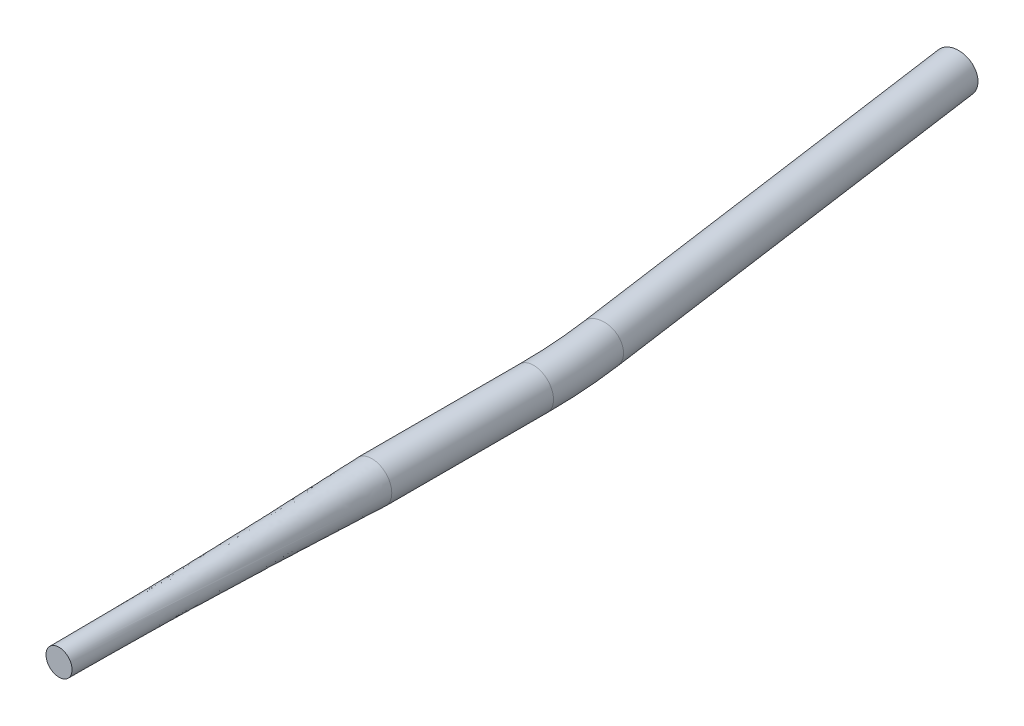
ISO-10303-21;
HEADER;
FILE_DESCRIPTION(('STEP AP214'),'2;1');
FILE_NAME('part.step','',(''),(''),'','','');
FILE_SCHEMA(('AUTOMOTIVE_DESIGN { 1 0 10303 214 1 1 1 1 }'));
ENDSEC;
DATA;
#1=APPLICATION_CONTEXT('core data for automotive mechanical design processes');
#2=APPLICATION_PROTOCOL_DEFINITION('international standard','automotive_design',2000,#1);
#3=PRODUCT_CONTEXT('',#1,'mechanical');
#4=PRODUCT('Part','Part','',(#3));
#5=PRODUCT_RELATED_PRODUCT_CATEGORY('part','',(#4));
#6=PRODUCT_DEFINITION_FORMATION('','',#4);
#7=PRODUCT_DEFINITION_CONTEXT('part definition',#1,'design');
#8=PRODUCT_DEFINITION('design','',#6,#7);
#9=PRODUCT_DEFINITION_SHAPE('','',#8);
#10=(LENGTH_UNIT() NAMED_UNIT(*) SI_UNIT(.MILLI.,.METRE.));
#11=(NAMED_UNIT(*) PLANE_ANGLE_UNIT() SI_UNIT($,.RADIAN.));
#12=(NAMED_UNIT(*) SI_UNIT($,.STERADIAN.) SOLID_ANGLE_UNIT());
#13=UNCERTAINTY_MEASURE_WITH_UNIT(LENGTH_MEASURE(1.E-05),#10,'distance_accuracy_value','');
#14=(GEOMETRIC_REPRESENTATION_CONTEXT(3) GLOBAL_UNCERTAINTY_ASSIGNED_CONTEXT((#13)) GLOBAL_UNIT_ASSIGNED_CONTEXT((#10,
#11,#12)) REPRESENTATION_CONTEXT('',''));
#15=CARTESIAN_POINT('',(0.,0.,0.));
#16=DIRECTION('',(0.,0.,1.));
#17=DIRECTION('',(1.,0.,0.));
#18=AXIS2_PLACEMENT_3D('',#15,#16,#17);
#19=CARTESIAN_POINT('',(0.,0.,0.));
#20=DIRECTION('',(0.,0.,-1.));
#21=DIRECTION('',(-1.,0.,0.));
#22=AXIS2_PLACEMENT_3D('',#19,#20,#21);
#23=CYLINDRICAL_SURFACE('',#22,9.5);
#24=CARTESIAN_POINT('',(0.,0.,-77.5182970141215));
#25=DIRECTION('',(0.,0.,1.));
#26=DIRECTION('',(1.,0.,0.));
#27=AXIS2_PLACEMENT_3D('',#24,#25,#26);
#28=CIRCLE('',#27,9.5);
#29=CARTESIAN_POINT('',(9.50000000000001,0.,-77.5182970141215));
#30=VERTEX_POINT('',#29);
#31=EDGE_CURVE('E64',#30,#30,#28,.T.);
#32=ORIENTED_EDGE('',*,*,#31,.T.);
#33=EDGE_LOOP('',(#32));
#34=FACE_BOUND('',#33,.T.);
#35=CARTESIAN_POINT('',(0.,0.,0.));
#36=DIRECTION('',(0.,0.,1.));
#37=DIRECTION('',(1.,0.,0.));
#38=AXIS2_PLACEMENT_3D('',#35,#36,#37);
#39=CIRCLE('',#38,9.5);
#40=CARTESIAN_POINT('',(9.5,0.,0.));
#41=VERTEX_POINT('',#40);
#42=EDGE_CURVE('E62',#41,#41,#39,.T.);
#43=ORIENTED_EDGE('',*,*,#42,.F.);
#44=EDGE_LOOP('',(#43));
#45=FACE_BOUND('',#44,.T.);
#46=ADVANCED_FACE('F41',(#34,#45),#23,.T.);
#47=CARTESIAN_POINT('',(-250.,0.,-77.5182970141223));
#48=DIRECTION('',(0.,1.,0.));
#49=DIRECTION('',(0.,0.,1.));
#50=AXIS2_PLACEMENT_3D('',#47,#48,#49);
#51=TOROIDAL_SURFACE('',#50,250.,9.5);
#52=CARTESIAN_POINT('',(-2.43298281460755,0.,-112.31157225414));
#53=DIRECTION('',(0.139173100960069,0.,0.99026806874157));
#54=DIRECTION('',(0.99026806874157,0.,-0.139173100960069));
#55=AXIS2_PLACEMENT_3D('',#52,#53,#54);
#56=CIRCLE('',#55,9.5);
#57=CARTESIAN_POINT('',(6.97456383843736,0.,-113.63371671326));
#58=VERTEX_POINT('',#57);
#59=EDGE_CURVE('E45',#58,#58,#56,.T.);
#60=CARTESIAN_POINT('',(-250.,0.,-77.5182970141223));
#61=DIRECTION('',(0.,1.,0.));
#62=DIRECTION('',(0.,0.,1.));
#63=AXIS2_PLACEMENT_3D('',#60,#61,#62);
#64=CIRCLE('',#63,259.5);
#65=EDGE_CURVE('',#30,#58,#64,.T.);
#66=ORIENTED_EDGE('',*,*,#31,.F.);
#67=ORIENTED_EDGE('',*,*,#59,.T.);
#68=ORIENTED_EDGE('',*,*,#65,.T.);
#69=ORIENTED_EDGE('',*,*,#65,.F.);
#70=EDGE_LOOP('',(#66,#68,#67,#69));
#71=FACE_BOUND('',#70,.T.);
#72=ADVANCED_FACE('F101',(#71),#51,.T.);
#73=CARTESIAN_POINT('',(-2.43298281460755,0.,-112.31157225414));
#74=DIRECTION('',(-0.139173100960066,0.,-0.99026806874157));
#75=DIRECTION('',(-0.99026806874157,0.,0.139173100960066));
#76=AXIS2_PLACEMENT_3D('',#73,#74,#75);
#77=CYLINDRICAL_SURFACE('',#76,9.5);
#78=CARTESIAN_POINT('',(-30.2162794610143,0.,-310.));
#79=DIRECTION('',(0.139173100960066,0.,0.99026806874157));
#80=DIRECTION('',(0.99026806874157,0.,-0.139173100960066));
#81=AXIS2_PLACEMENT_3D('',#78,#79,#80);
#82=CIRCLE('',#81,9.5);
#83=CARTESIAN_POINT('',(-20.8087328079693,0.,-311.322144459121));
#84=VERTEX_POINT('',#83);
#85=EDGE_CURVE('E58',#84,#84,#82,.T.);
#86=ORIENTED_EDGE('',*,*,#85,.T.);
#87=EDGE_LOOP('',(#86));
#88=FACE_BOUND('',#87,.T.);
#89=ORIENTED_EDGE('',*,*,#59,.F.);
#90=EDGE_LOOP('',(#89));
#91=FACE_BOUND('',#90,.T.);
#92=ADVANCED_FACE('F43',(#88,#91),#77,.T.);
#93=CARTESIAN_POINT('',(-30.2162794610143,0.,-310.));
#94=DIRECTION('',(0.139173100960066,0.,0.99026806874157));
#95=DIRECTION('',(0.99026806874157,0.,-0.139173100960066));
#96=AXIS2_PLACEMENT_3D('',#93,#94,#95);
#97=PLANE('',#96);
#98=CARTESIAN_POINT('',(-30.2162794610143,0.,-310.));
#99=DIRECTION('',(0.139173100960066,0.,0.99026806874157));
#100=DIRECTION('',(0.99026806874157,0.,-0.139173100960066));
#101=AXIS2_PLACEMENT_3D('',#98,#99,#100);
#102=CIRCLE('',#101,8.9);
#103=CARTESIAN_POINT('',(-21.4028936492143,0.,-311.238640598545));
#104=VERTEX_POINT('',#103);
#105=EDGE_CURVE('E10',#104,#104,#102,.F.);
#106=ORIENTED_EDGE('',*,*,#105,.F.);
#107=EDGE_LOOP('',(#106));
#108=FACE_BOUND('',#107,.T.);
#109=ORIENTED_EDGE('',*,*,#85,.F.);
#110=EDGE_LOOP('',(#109));
#111=FACE_BOUND('',#110,.T.);
#112=ADVANCED_FACE('F93',(#108,#111),#97,.F.);
#113=CARTESIAN_POINT('',(0.,0.,0.));
#114=DIRECTION('',(0.,0.,-1.));
#115=DIRECTION('',(-1.,0.,0.));
#116=AXIS2_PLACEMENT_3D('',#113,#114,#115);
#117=CYLINDRICAL_SURFACE('',#116,8.9);
#118=CARTESIAN_POINT('',(0.,0.,-77.5182970141215));
#119=DIRECTION('',(0.,0.,1.));
#120=DIRECTION('',(1.,0.,0.));
#121=AXIS2_PLACEMENT_3D('',#118,#119,#120);
#122=CIRCLE('',#121,8.9);
#123=CARTESIAN_POINT('',(8.90000000000002,0.,-77.5182970141215));
#124=VERTEX_POINT('',#123);
#125=EDGE_CURVE('E54',#124,#124,#122,.F.);
#126=ORIENTED_EDGE('',*,*,#125,.T.);
#127=EDGE_LOOP('',(#126));
#128=FACE_BOUND('',#127,.T.);
#129=CARTESIAN_POINT('',(0.,0.,0.));
#130=DIRECTION('',(0.,0.,1.));
#131=DIRECTION('',(1.,0.,0.));
#132=AXIS2_PLACEMENT_3D('',#129,#130,#131);
#133=CIRCLE('',#132,8.9);
#134=CARTESIAN_POINT('',(8.9,0.,0.));
#135=VERTEX_POINT('',#134);
#136=EDGE_CURVE('E61',#135,#135,#133,.F.);
#137=ORIENTED_EDGE('',*,*,#136,.F.);
#138=EDGE_LOOP('',(#137));
#139=FACE_BOUND('',#138,.T.);
#140=ADVANCED_FACE('F79',(#128,#139),#117,.F.);
#141=CARTESIAN_POINT('',(-250.,0.,-77.5182970141223));
#142=DIRECTION('',(0.,1.,0.));
#143=DIRECTION('',(0.,0.,1.));
#144=AXIS2_PLACEMENT_3D('',#141,#142,#143);
#145=TOROIDAL_SURFACE('',#144,250.,8.9);
#146=CARTESIAN_POINT('',(-2.43298281460755,0.,-112.31157225414));
#147=DIRECTION('',(0.139173100960069,0.,0.99026806874157));
#148=DIRECTION('',(0.99026806874157,0.,-0.139173100960069));
#149=AXIS2_PLACEMENT_3D('',#146,#147,#148);
#150=CIRCLE('',#149,8.9);
#151=CARTESIAN_POINT('',(6.38040299719245,0.,-113.550212852684));
#152=VERTEX_POINT('',#151);
#153=EDGE_CURVE('E49',#152,#152,#150,.F.);
#154=CARTESIAN_POINT('',(-250.,0.,-77.5182970141223));
#155=DIRECTION('',(0.,1.,0.));
#156=DIRECTION('',(0.,0.,1.));
#157=AXIS2_PLACEMENT_3D('',#154,#155,#156);
#158=CIRCLE('',#157,258.9);
#159=EDGE_CURVE('',#124,#152,#158,.T.);
#160=ORIENTED_EDGE('',*,*,#125,.F.);
#161=ORIENTED_EDGE('',*,*,#153,.T.);
#162=ORIENTED_EDGE('',*,*,#159,.T.);
#163=ORIENTED_EDGE('',*,*,#159,.F.);
#164=EDGE_LOOP('',(#160,#162,#161,#163));
#165=FACE_BOUND('',#164,.T.);
#166=ADVANCED_FACE('F82',(#165),#145,.F.);
#167=CARTESIAN_POINT('',(-2.43298281460755,0.,-112.31157225414));
#168=DIRECTION('',(-0.139173100960066,0.,-0.99026806874157));
#169=DIRECTION('',(-0.99026806874157,0.,0.139173100960066));
#170=AXIS2_PLACEMENT_3D('',#167,#168,#169);
#171=CYLINDRICAL_SURFACE('',#170,8.9);
#172=ORIENTED_EDGE('',*,*,#105,.T.);
#173=EDGE_LOOP('',(#172));
#174=FACE_BOUND('',#173,.T.);
#175=ORIENTED_EDGE('',*,*,#153,.F.);
#176=EDGE_LOOP('',(#175));
#177=FACE_BOUND('',#176,.T.);
#178=ADVANCED_FACE('F84',(#174,#177),#171,.F.);
#179=CARTESIAN_POINT('',(0.,0.,0.));
#180=DIRECTION('',(0.,0.,1.));
#181=DIRECTION('',(1.,0.,0.));
#182=AXIS2_PLACEMENT_3D('',#179,#180,#181);
#183=PLANE('',#182);
#184=ORIENTED_EDGE('',*,*,#136,.T.);
#185=EDGE_LOOP('',(#184));
#186=FACE_BOUND('',#185,.T.);
#187=ADVANCED_FACE('F91',(#186),#183,.F.);
#188=CARTESIAN_POINT('',(0.,0.,150.));
#189=DIRECTION('',(0.,0.,-1.));
#190=DIRECTION('',(-1.,0.,0.));
#191=AXIS2_PLACEMENT_3D('',#188,#189,#190);
#192=PLANE('',#191);
#193=CARTESIAN_POINT('',(0.,0.,150.));
#194=DIRECTION('',(0.,0.,-1.));
#195=DIRECTION('',(0.667884516592106,0.74426492090957,0.));
#196=AXIS2_PLACEMENT_3D('',#193,#194,#195);
#197=CIRCLE('',#196,6.25);
#198=CARTESIAN_POINT('',(4.17427822870066,4.65165575568481,150.));
#199=VERTEX_POINT('',#198);
#200=EDGE_CURVE('E66',#199,#199,#197,.T.);
#201=ORIENTED_EDGE('',*,*,#200,.F.);
#202=EDGE_LOOP('',(#201));
#203=FACE_BOUND('',#202,.T.);
#204=ADVANCED_FACE('F145',(#203),#192,.F.);
#205=CARTESIAN_POINT('',(4.17427822870066,4.65165575568481,150.));
#206=CARTESIAN_POINT('',(9.5,0.,0.));
#207=CARTESIAN_POINT('',(13.4775897400703,-3.69690070171652,150.));
#208=CARTESIAN_POINT('',(9.5,-19.,0.));
#209=CARTESIAN_POINT('',(5.12903328266896,-13.0002122130861,150.));
#210=CARTESIAN_POINT('',(-9.5,-19.,0.));
#211=CARTESIAN_POINT('',(-4.17427822870067,-4.65165575568481,150.));
#212=CARTESIAN_POINT('',(-9.5,0.,0.));
#213=CARTESIAN_POINT('',(-13.4775897400703,3.69690070171652,150.));
#214=CARTESIAN_POINT('',(-9.5,19.,0.));
#215=CARTESIAN_POINT('',(-5.12903328266896,13.0002122130861,150.));
#216=CARTESIAN_POINT('',(9.5,19.,0.));
#217=CARTESIAN_POINT('',(4.17427822870066,4.65165575568481,150.));
#218=CARTESIAN_POINT('',(9.5,0.,0.));
#219=(BOUNDED_SURFACE() B_SPLINE_SURFACE(3,1,((#205,#206),(#207,#208),(#209,#210),(#211,#212),
(#213,#214),(#215,#216),(#217,#218)),.UNSPECIFIED.,.T.,.F.,.F.) B_SPLINE_SURFACE_WITH_KNOTS((4,
3,4),(2,2),(0.,0.5,1.),(0.,1.),
.UNSPECIFIED.) GEOMETRIC_REPRESENTATION_ITEM() RATIONAL_B_SPLINE_SURFACE(((1.,1.),
(0.333333333333333,0.333333333333333),(0.333333333333333,0.333333333333333),(1.,1.),
(0.333333333333333,0.333333333333333),(0.333333333333333,0.333333333333333),(1.,1.))) REPRESENTATION_ITEM('') SURFACE());
#220=CARTESIAN_POINT('',(4.17427822870066,4.65165575568481,150.));
#221=CARTESIAN_POINT('',(4.2297544971517,4.60320100822976,148.4375));
#222=CARTESIAN_POINT('',(4.28523076560273,4.55474626077471,146.875));
#223=CARTESIAN_POINT('',(4.3961833025048,4.45783676586461,143.75));
#224=CARTESIAN_POINT('',(4.45165957095584,4.40938201840956,142.1875));
#225=CARTESIAN_POINT('',(4.56261210785791,4.31247252349946,139.0625));
#226=CARTESIAN_POINT('',(4.61808837630894,4.26401777604441,137.5));
#227=CARTESIAN_POINT('',(4.72904091321101,4.16710828113431,134.375));
#228=CARTESIAN_POINT('',(4.78451718166205,4.11865353367926,132.8125));
#229=CARTESIAN_POINT('',(4.89546971856412,4.02174403876916,129.6875));
#230=CARTESIAN_POINT('',(4.95094598701515,3.97328929131411,128.125));
#231=CARTESIAN_POINT('',(5.06189852391722,3.87637979640401,125.));
#232=CARTESIAN_POINT('',(5.11737479236825,3.82792504894896,123.4375));
#233=CARTESIAN_POINT('',(5.22832732927032,3.73101555403886,120.3125));
#234=CARTESIAN_POINT('',(5.28380359772136,3.68256080658381,118.75));
#235=CARTESIAN_POINT('',(5.39475613462343,3.58565131167371,115.625));
#236=CARTESIAN_POINT('',(5.45023240307446,3.53719656421866,114.0625));
#237=CARTESIAN_POINT('',(5.56118493997653,3.44028706930856,110.9375));
#238=CARTESIAN_POINT('',(5.61666120842757,3.39183232185351,109.375));
#239=CARTESIAN_POINT('',(5.72761374532964,3.29492282694341,106.25));
#240=CARTESIAN_POINT('',(5.78309001378067,3.24646807948836,104.6875));
#241=CARTESIAN_POINT('',(5.89404255068274,3.14955858457826,101.5625));
#242=CARTESIAN_POINT('',(5.94951881913378,3.10110383712321,100.));
#243=CARTESIAN_POINT('',(6.06047135603584,3.00419434221311,96.875));
#244=CARTESIAN_POINT('',(6.11594762448688,2.95573959475806,95.3125));
#245=CARTESIAN_POINT('',(6.22690016138895,2.85883009984796,92.1875));
#246=CARTESIAN_POINT('',(6.28237642983998,2.81037535239291,90.625));
#247=CARTESIAN_POINT('',(6.39332896674205,2.71346585748281,87.5));
#248=CARTESIAN_POINT('',(6.44880523519309,2.66501111002776,85.9375));
#249=CARTESIAN_POINT('',(6.55975777209516,2.56810161511766,82.8125));
#250=CARTESIAN_POINT('',(6.61523404054619,2.51964686766261,81.25));
#251=CARTESIAN_POINT('',(6.72618657744826,2.42273737275251,78.125));
#252=CARTESIAN_POINT('',(6.7816628458993,2.37428262529746,76.5625));
#253=CARTESIAN_POINT('',(6.89261538280137,2.27737313038736,73.4375));
#254=CARTESIAN_POINT('',(6.9480916512524,2.22891838293231,71.875));
#255=CARTESIAN_POINT('',(7.05904418815447,2.13200888802221,68.75));
#256=CARTESIAN_POINT('',(7.11452045660551,2.08355414056716,67.1875));
#257=CARTESIAN_POINT('',(7.22547299350757,1.98664464565706,64.0625));
#258=CARTESIAN_POINT('',(7.28094926195861,1.93818989820201,62.5));
#259=CARTESIAN_POINT('',(7.39190179886068,1.84128040329191,59.375));
#260=CARTESIAN_POINT('',(7.44737806731171,1.79282565583686,57.8125));
#261=CARTESIAN_POINT('',(7.55833060421378,1.69591616092675,54.6875));
#262=CARTESIAN_POINT('',(7.61380687266482,1.6474614134717,53.125));
#263=CARTESIAN_POINT('',(7.72475940956689,1.5505519185616,50.));
#264=CARTESIAN_POINT('',(7.78023567801792,1.50209717110655,48.4375));
#265=CARTESIAN_POINT('',(7.89118821491999,1.40518767619645,45.3125));
#266=CARTESIAN_POINT('',(7.94666448337103,1.3567329287414,43.75));
#267=CARTESIAN_POINT('',(8.0576170202731,1.2598234338313,40.625));
#268=CARTESIAN_POINT('',(8.11309328872413,1.21136868637625,39.0625));
#269=CARTESIAN_POINT('',(8.2240458256262,1.11445919146615,35.9375));
#270=CARTESIAN_POINT('',(8.27952209407723,1.0660044440111,34.375));
#271=CARTESIAN_POINT('',(8.3904746309793,0.969094949101003,31.25));
#272=CARTESIAN_POINT('',(8.44595089943034,0.920640201645953,29.6875));
#273=CARTESIAN_POINT('',(8.55690343633241,0.823730706735852,26.5625));
#274=CARTESIAN_POINT('',(8.61237970478344,0.775275959280802,25.));
#275=CARTESIAN_POINT('',(8.72333224168551,0.678366464370702,21.875));
#276=CARTESIAN_POINT('',(8.77880851013655,0.629911716915652,20.3125));
#277=CARTESIAN_POINT('',(8.88976104703862,0.533002222005551,17.1875));
#278=CARTESIAN_POINT('',(8.94523731548965,0.484547474550501,15.625));
#279=CARTESIAN_POINT('',(9.05618985239172,0.387637979640401,12.5));
#280=CARTESIAN_POINT('',(9.11166612084276,0.339183232185351,10.9375));
#281=CARTESIAN_POINT('',(9.22261865774483,0.242273737275251,7.8125));
#282=CARTESIAN_POINT('',(9.27809492619586,0.193818989820201,6.25));
#283=CARTESIAN_POINT('',(9.38904746309793,0.0969094949101003,3.125));
#284=CARTESIAN_POINT('',(9.44452373154896,0.0484547474550501,1.5625));
#285=CARTESIAN_POINT('',(9.5,0.,0.));
#286=B_SPLINE_CURVE_WITH_KNOTS('',3,(#220,#221,#222,#223,#224,#225,#226,#227,#228,#229,#230,
#231,#232,#233,#234,#235,#236,#237,#238,#239,#240,#241,#242,#243,#244,#245,#246,#247,#248,#249,
#250,#251,#252,#253,#254,#255,#256,#257,#258,#259,#260,#261,#262,#263,#264,#265,#266,#267,#268,
#269,#270,#271,#272,#273,#274,#275,#276,#277,#278,#279,#280,#281,#282,#283,#284,#285),
.UNSPECIFIED.,.F.,.F.,(4,2,2,2,2,2,2,2,2,2,2,2,2,2,2,2,2,2,2,2,2,2,2,2,2,2,2,2,2,2,2,2,4),(0.,
4.69270556930751,9.385411138615,14.0781167079225,18.77082227723,23.4635278465375,
28.156233415845,32.8489389851525,37.54164455446,42.2343501237675,46.927055693075,
51.6197612623825,56.31246683169,61.0051724009976,65.6978779703051,70.3905835396125,
75.0832891089201,79.7759946782275,84.468700247535,89.1614058168425,93.8541113861501,
98.5468169554576,103.239522524765,107.932228094073,112.62493366338,117.317639232688,
122.010344801995,126.703050371303,131.39575594061,136.088461509918,140.781167079225,
145.473872648533,150.16657821784),.UNSPECIFIED.);
#287=EDGE_CURVE('BSEAM155',#199,#41,#286,.T.);
#288=ORIENTED_EDGE('',*,*,#200,.T.);
#289=ORIENTED_EDGE('',*,*,#42,.T.);
#290=ORIENTED_EDGE('',*,*,#287,.T.);
#291=ORIENTED_EDGE('',*,*,#287,.F.);
#292=EDGE_LOOP('',(#288,#290,#289,#291));
#293=FACE_BOUND('',#292,.T.);
#294=ADVANCED_FACE('F155',(#293),#219,.T.);
#295=CLOSED_SHELL('',(#46,#72,#92,#112,#140,#166,#178,#187,#204,#294));
#296=MANIFOLD_SOLID_BREP('B2',#295);
#297=ADVANCED_BREP_SHAPE_REPRESENTATION('',(#18,#296),#14);
#298=SHAPE_DEFINITION_REPRESENTATION(#9,#297);
ENDSEC;
END-ISO-10303-21;
